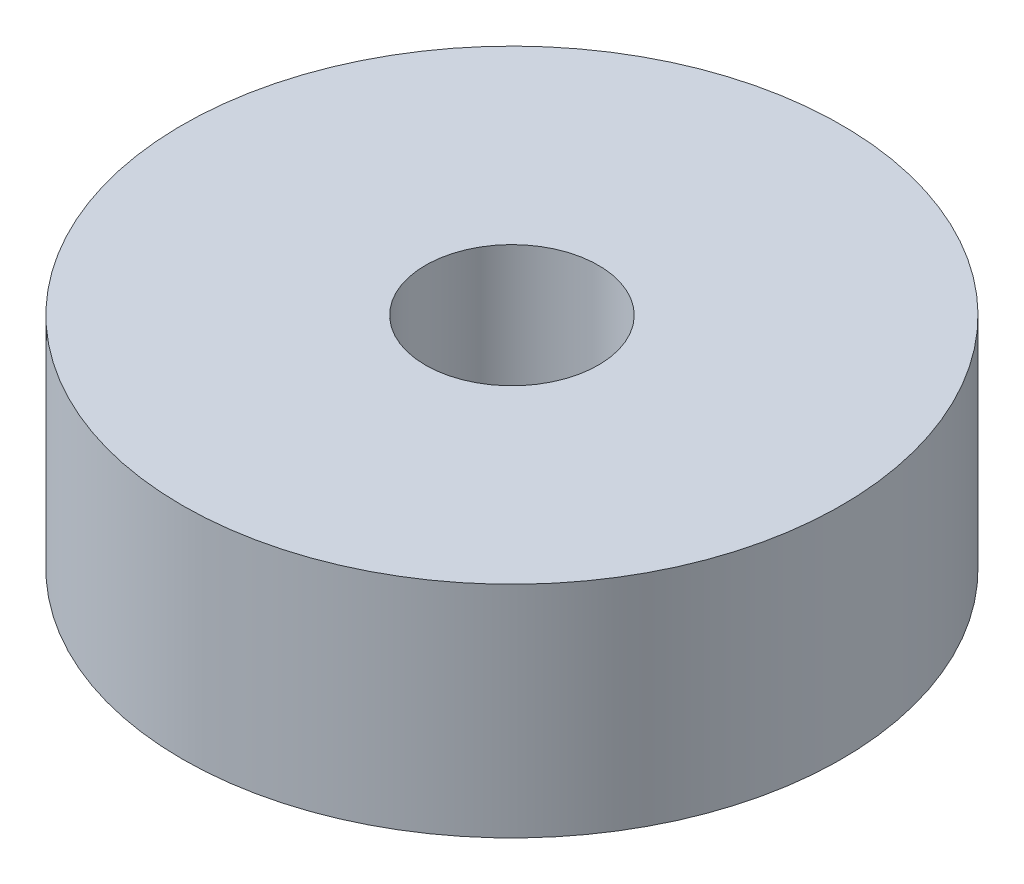
ISO-10303-21;
HEADER;
FILE_DESCRIPTION(('STEP AP214'),'2;1');
FILE_NAME('part.step','',(''),(''),'','','');
FILE_SCHEMA(('AUTOMOTIVE_DESIGN { 1 0 10303 214 1 1 1 1 }'));
ENDSEC;
DATA;
#1=APPLICATION_CONTEXT('core data for automotive mechanical design processes');
#2=APPLICATION_PROTOCOL_DEFINITION('international standard','automotive_design',2000,#1);
#3=PRODUCT_CONTEXT('',#1,'mechanical');
#4=PRODUCT('Part','Part','',(#3));
#5=PRODUCT_RELATED_PRODUCT_CATEGORY('part','',(#4));
#6=PRODUCT_DEFINITION_FORMATION('','',#4);
#7=PRODUCT_DEFINITION_CONTEXT('part definition',#1,'design');
#8=PRODUCT_DEFINITION('design','',#6,#7);
#9=PRODUCT_DEFINITION_SHAPE('','',#8);
#10=(LENGTH_UNIT() NAMED_UNIT(*) SI_UNIT(.MILLI.,.METRE.));
#11=(NAMED_UNIT(*) PLANE_ANGLE_UNIT() SI_UNIT($,.RADIAN.));
#12=(NAMED_UNIT(*) SI_UNIT($,.STERADIAN.) SOLID_ANGLE_UNIT());
#13=UNCERTAINTY_MEASURE_WITH_UNIT(LENGTH_MEASURE(1.E-05),#10,'distance_accuracy_value','');
#14=(GEOMETRIC_REPRESENTATION_CONTEXT(3) GLOBAL_UNCERTAINTY_ASSIGNED_CONTEXT((#13)) GLOBAL_UNIT_ASSIGNED_CONTEXT((#10,
#11,#12)) REPRESENTATION_CONTEXT('',''));
#15=CARTESIAN_POINT('',(0.,0.,0.));
#16=DIRECTION('',(0.,0.,1.));
#17=DIRECTION('',(1.,0.,0.));
#18=AXIS2_PLACEMENT_3D('',#15,#16,#17);
#19=CARTESIAN_POINT('',(0.,12.7,0.));
#20=DIRECTION('',(0.,1.,0.));
#21=DIRECTION('',(0.,0.,1.));
#22=AXIS2_PLACEMENT_3D('',#19,#20,#21);
#23=PLANE('',#22);
#24=CARTESIAN_POINT('',(0.,12.7,0.));
#25=DIRECTION('',(0.,1.,0.));
#26=DIRECTION('',(0.,0.,1.));
#27=AXIS2_PLACEMENT_3D('',#24,#25,#26);
#28=CIRCLE('',#27,19.05);
#29=CARTESIAN_POINT('',(0.,12.7,19.05));
#30=VERTEX_POINT('',#29);
#31=EDGE_CURVE('E10',#30,#30,#28,.T.);
#32=ORIENTED_EDGE('',*,*,#31,.T.);
#33=EDGE_LOOP('',(#32));
#34=FACE_BOUND('',#33,.T.);
#35=CARTESIAN_POINT('',(0.,12.7,0.));
#36=DIRECTION('',(0.,1.,0.));
#37=DIRECTION('',(0.,0.,1.));
#38=AXIS2_PLACEMENT_3D('',#35,#36,#37);
#39=CIRCLE('',#38,5.);
#40=CARTESIAN_POINT('',(0.,12.7,5.));
#41=VERTEX_POINT('',#40);
#42=EDGE_CURVE('E43',#41,#41,#39,.T.);
#43=ORIENTED_EDGE('',*,*,#42,.F.);
#44=EDGE_LOOP('',(#43));
#45=FACE_BOUND('',#44,.T.);
#46=ADVANCED_FACE('F32',(#34,#45),#23,.T.);
#47=CARTESIAN_POINT('',(0.,0.,0.));
#48=DIRECTION('',(0.,1.,0.));
#49=DIRECTION('',(0.,0.,1.));
#50=AXIS2_PLACEMENT_3D('',#47,#48,#49);
#51=PLANE('',#50);
#52=CARTESIAN_POINT('',(0.,0.,0.));
#53=DIRECTION('',(0.,1.,0.));
#54=DIRECTION('',(0.,0.,1.));
#55=AXIS2_PLACEMENT_3D('',#52,#53,#54);
#56=CIRCLE('',#55,19.05);
#57=CARTESIAN_POINT('',(0.,0.,19.05));
#58=VERTEX_POINT('',#57);
#59=EDGE_CURVE('E36',#58,#58,#56,.T.);
#60=ORIENTED_EDGE('',*,*,#59,.F.);
#61=EDGE_LOOP('',(#60));
#62=FACE_BOUND('',#61,.T.);
#63=CARTESIAN_POINT('',(0.,0.,0.));
#64=DIRECTION('',(0.,1.,0.));
#65=DIRECTION('',(0.,0.,1.));
#66=AXIS2_PLACEMENT_3D('',#63,#64,#65);
#67=CIRCLE('',#66,5.);
#68=CARTESIAN_POINT('',(0.,0.,5.));
#69=VERTEX_POINT('',#68);
#70=EDGE_CURVE('E45',#69,#69,#67,.T.);
#71=ORIENTED_EDGE('',*,*,#70,.T.);
#72=EDGE_LOOP('',(#71));
#73=FACE_BOUND('',#72,.T.);
#74=ADVANCED_FACE('F55',(#62,#73),#51,.F.);
#75=CARTESIAN_POINT('',(0.,12.7,0.));
#76=DIRECTION('',(0.,-1.,0.));
#77=DIRECTION('',(0.,0.,-1.));
#78=AXIS2_PLACEMENT_3D('',#75,#76,#77);
#79=CYLINDRICAL_SURFACE('',#78,19.05);
#80=ORIENTED_EDGE('',*,*,#31,.F.);
#81=EDGE_LOOP('',(#80));
#82=FACE_BOUND('',#81,.T.);
#83=ORIENTED_EDGE('',*,*,#59,.T.);
#84=EDGE_LOOP('',(#83));
#85=FACE_BOUND('',#84,.T.);
#86=ADVANCED_FACE('F34',(#82,#85),#79,.T.);
#87=CARTESIAN_POINT('',(0.,12.7,0.));
#88=DIRECTION('',(0.,-1.,0.));
#89=DIRECTION('',(0.,0.,-1.));
#90=AXIS2_PLACEMENT_3D('',#87,#88,#89);
#91=CYLINDRICAL_SURFACE('',#90,5.);
#92=ORIENTED_EDGE('',*,*,#42,.T.);
#93=EDGE_LOOP('',(#92));
#94=FACE_BOUND('',#93,.T.);
#95=ORIENTED_EDGE('',*,*,#70,.F.);
#96=EDGE_LOOP('',(#95));
#97=FACE_BOUND('',#96,.T.);
#98=ADVANCED_FACE('F51',(#94,#97),#91,.F.);
#99=CLOSED_SHELL('',(#46,#74,#86,#98));
#100=MANIFOLD_SOLID_BREP('B2',#99);
#101=ADVANCED_BREP_SHAPE_REPRESENTATION('',(#18,#100),#14);
#102=SHAPE_DEFINITION_REPRESENTATION(#9,#101);
ENDSEC;
END-ISO-10303-21;
